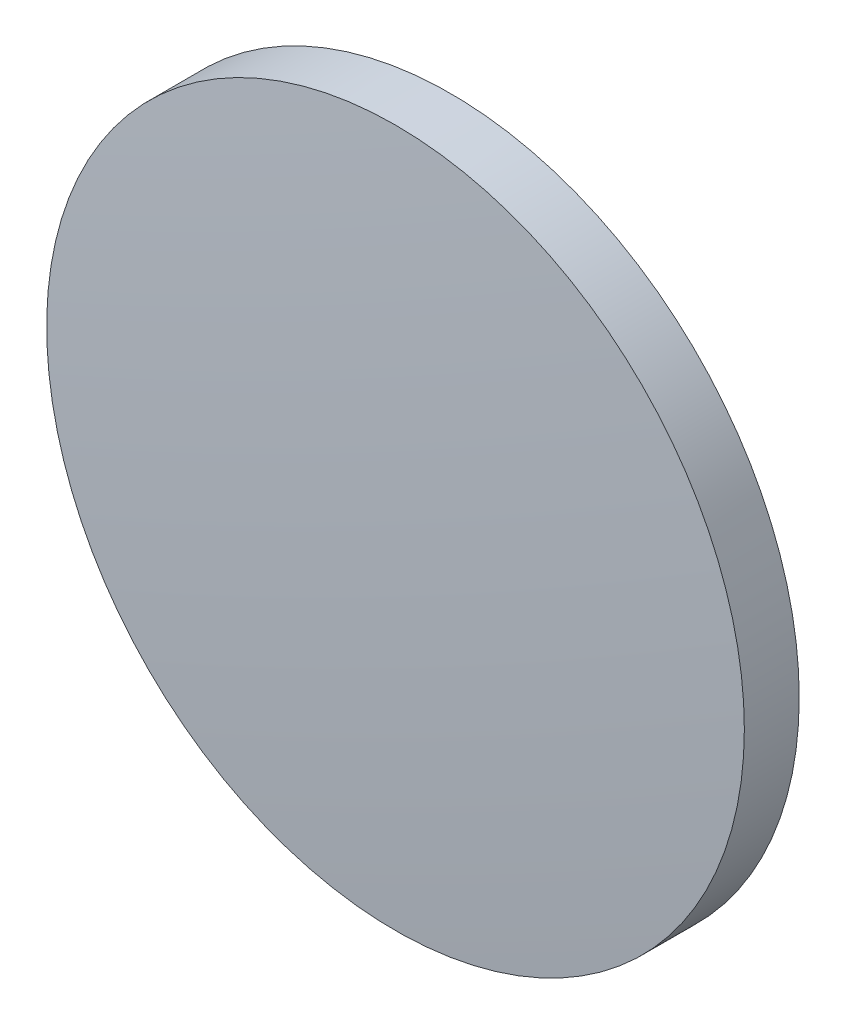
ISO-10303-21;
HEADER;
FILE_DESCRIPTION(('STEP AP214'),'2;1');
FILE_NAME('part.step','',(''),(''),'','','');
FILE_SCHEMA(('AUTOMOTIVE_DESIGN { 1 0 10303 214 1 1 1 1 }'));
ENDSEC;
DATA;
#1=APPLICATION_CONTEXT('core data for automotive mechanical design processes');
#2=APPLICATION_PROTOCOL_DEFINITION('international standard','automotive_design',2000,#1);
#3=PRODUCT_CONTEXT('',#1,'mechanical');
#4=PRODUCT('Part','Part','',(#3));
#5=PRODUCT_RELATED_PRODUCT_CATEGORY('part','',(#4));
#6=PRODUCT_DEFINITION_FORMATION('','',#4);
#7=PRODUCT_DEFINITION_CONTEXT('part definition',#1,'design');
#8=PRODUCT_DEFINITION('design','',#6,#7);
#9=PRODUCT_DEFINITION_SHAPE('','',#8);
#10=(LENGTH_UNIT() NAMED_UNIT(*) SI_UNIT(.MILLI.,.METRE.));
#11=(NAMED_UNIT(*) PLANE_ANGLE_UNIT() SI_UNIT($,.RADIAN.));
#12=(NAMED_UNIT(*) SI_UNIT($,.STERADIAN.) SOLID_ANGLE_UNIT());
#13=UNCERTAINTY_MEASURE_WITH_UNIT(LENGTH_MEASURE(1.E-05),#10,'distance_accuracy_value','');
#14=(GEOMETRIC_REPRESENTATION_CONTEXT(3) GLOBAL_UNCERTAINTY_ASSIGNED_CONTEXT((#13)) GLOBAL_UNIT_ASSIGNED_CONTEXT((#10,
#11,#12)) REPRESENTATION_CONTEXT('',''));
#15=CARTESIAN_POINT('',(0.,0.,0.));
#16=DIRECTION('',(0.,0.,1.));
#17=DIRECTION('',(1.,0.,0.));
#18=AXIS2_PLACEMENT_3D('',#15,#16,#17);
#19=CARTESIAN_POINT('',(0.,0.,-204.835));
#20=DIRECTION('',(0.,0.,1.));
#21=DIRECTION('',(0.,1.,0.));
#22=AXIS2_PLACEMENT_3D('',#19,#20,#21);
#23=SPHERICAL_SURFACE('',#22,206.03);
#24=CARTESIAN_POINT('',(0.,0.,0.80320389217562));
#25=DIRECTION('',(0.,0.,1.));
#26=DIRECTION('',(1.,0.,0.));
#27=AXIS2_PLACEMENT_3D('',#24,#25,#26);
#28=CIRCLE('',#27,12.7);
#29=CARTESIAN_POINT('',(12.7,0.,0.80320389217562));
#30=VERTEX_POINT('',#29);
#31=EDGE_CURVE('E8',#30,#30,#28,.T.);
#32=ORIENTED_EDGE('',*,*,#31,.T.);
#33=EDGE_LOOP('',(#32));
#34=FACE_BOUND('',#33,.T.);
#35=ADVANCED_FACE('F12',(#34),#23,.T.);
#36=CARTESIAN_POINT('',(0.,0.,4.30813204540037));
#37=DIRECTION('',(0.,0.,1.));
#38=DIRECTION('',(1.,0.,0.));
#39=AXIS2_PLACEMENT_3D('',#36,#37,#38);
#40=CYLINDRICAL_SURFACE('',#39,12.7);
#41=ORIENTED_EDGE('',*,*,#31,.F.);
#42=EDGE_LOOP('',(#41));
#43=FACE_BOUND('',#42,.T.);
#44=CARTESIAN_POINT('',(0.,0.,-1.195));
#45=DIRECTION('',(0.,0.,1.));
#46=DIRECTION('',(1.,0.,0.));
#47=AXIS2_PLACEMENT_3D('',#44,#45,#46);
#48=CIRCLE('',#47,12.7);
#49=CARTESIAN_POINT('',(12.7,0.,-1.195));
#50=VERTEX_POINT('',#49);
#51=EDGE_CURVE('E18',#50,#50,#48,.T.);
#52=ORIENTED_EDGE('',*,*,#51,.T.);
#53=EDGE_LOOP('',(#52));
#54=FACE_BOUND('',#53,.T.);
#55=ADVANCED_FACE('F24',(#43,#54),#40,.T.);
#56=CARTESIAN_POINT('',(0.,0.,-1.195));
#57=DIRECTION('',(0.,0.,1.));
#58=DIRECTION('',(1.,0.,0.));
#59=AXIS2_PLACEMENT_3D('',#56,#57,#58);
#60=PLANE('',#59);
#61=ORIENTED_EDGE('',*,*,#51,.F.);
#62=EDGE_LOOP('',(#61));
#63=FACE_BOUND('',#62,.T.);
#64=ADVANCED_FACE('F26',(#63),#60,.F.);
#65=CLOSED_SHELL('',(#35,#55,#64));
#66=MANIFOLD_SOLID_BREP('B1',#65);
#67=ADVANCED_BREP_SHAPE_REPRESENTATION('',(#18,#66),#14);
#68=SHAPE_DEFINITION_REPRESENTATION(#9,#67);
ENDSEC;
END-ISO-10303-21;
